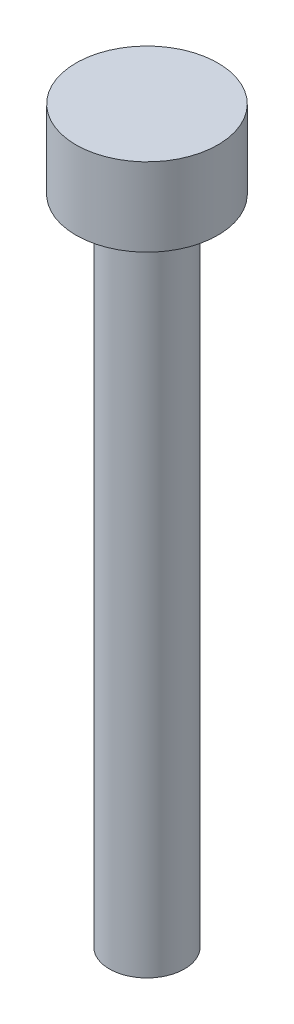
ISO-10303-21;
HEADER;
FILE_DESCRIPTION(('STEP AP214'),'2;1');
FILE_NAME('part.step','',(''),(''),'','','');
FILE_SCHEMA(('AUTOMOTIVE_DESIGN { 1 0 10303 214 1 1 1 1 }'));
ENDSEC;
DATA;
#1=APPLICATION_CONTEXT('core data for automotive mechanical design processes');
#2=APPLICATION_PROTOCOL_DEFINITION('international standard','automotive_design',2000,#1);
#3=PRODUCT_CONTEXT('',#1,'mechanical');
#4=PRODUCT('Part','Part','',(#3));
#5=PRODUCT_RELATED_PRODUCT_CATEGORY('part','',(#4));
#6=PRODUCT_DEFINITION_FORMATION('','',#4);
#7=PRODUCT_DEFINITION_CONTEXT('part definition',#1,'design');
#8=PRODUCT_DEFINITION('design','',#6,#7);
#9=PRODUCT_DEFINITION_SHAPE('','',#8);
#10=(LENGTH_UNIT() NAMED_UNIT(*) SI_UNIT(.MILLI.,.METRE.));
#11=(NAMED_UNIT(*) PLANE_ANGLE_UNIT() SI_UNIT($,.RADIAN.));
#12=(NAMED_UNIT(*) SI_UNIT($,.STERADIAN.) SOLID_ANGLE_UNIT());
#13=UNCERTAINTY_MEASURE_WITH_UNIT(LENGTH_MEASURE(1.E-05),#10,'distance_accuracy_value','');
#14=(GEOMETRIC_REPRESENTATION_CONTEXT(3) GLOBAL_UNCERTAINTY_ASSIGNED_CONTEXT((#13)) GLOBAL_UNIT_ASSIGNED_CONTEXT((#10,
#11,#12)) REPRESENTATION_CONTEXT('',''));
#15=CARTESIAN_POINT('',(0.,0.,0.));
#16=DIRECTION('',(0.,0.,1.));
#17=DIRECTION('',(1.,0.,0.));
#18=AXIS2_PLACEMENT_3D('',#15,#16,#17);
#19=CARTESIAN_POINT('',(0.,3.,0.));
#20=DIRECTION('',(0.,-1.,0.));
#21=DIRECTION('',(0.,0.,-1.));
#22=AXIS2_PLACEMENT_3D('',#19,#20,#21);
#23=CYLINDRICAL_SURFACE('',#22,2.72);
#24=CARTESIAN_POINT('',(0.,3.,0.));
#25=DIRECTION('',(0.,1.,0.));
#26=DIRECTION('',(0.,0.,1.));
#27=AXIS2_PLACEMENT_3D('',#24,#25,#26);
#28=CIRCLE('',#27,2.72);
#29=CARTESIAN_POINT('',(0.,3.,2.72));
#30=VERTEX_POINT('',#29);
#31=EDGE_CURVE('E40',#30,#30,#28,.T.);
#32=ORIENTED_EDGE('',*,*,#31,.F.);
#33=EDGE_LOOP('',(#32));
#34=FACE_BOUND('',#33,.T.);
#35=CARTESIAN_POINT('',(0.,0.,0.));
#36=DIRECTION('',(0.,1.,0.));
#37=DIRECTION('',(0.,0.,1.));
#38=AXIS2_PLACEMENT_3D('',#35,#36,#37);
#39=CIRCLE('',#38,2.72);
#40=CARTESIAN_POINT('',(0.,0.,2.72));
#41=VERTEX_POINT('',#40);
#42=EDGE_CURVE('E36',#41,#41,#39,.T.);
#43=ORIENTED_EDGE('',*,*,#42,.T.);
#44=EDGE_LOOP('',(#43));
#45=FACE_BOUND('',#44,.T.);
#46=ADVANCED_FACE('F33',(#34,#45),#23,.T.);
#47=CARTESIAN_POINT('',(0.,3.,0.));
#48=DIRECTION('',(0.,1.,0.));
#49=DIRECTION('',(0.,0.,1.));
#50=AXIS2_PLACEMENT_3D('',#47,#48,#49);
#51=PLANE('',#50);
#52=ORIENTED_EDGE('',*,*,#31,.T.);
#53=EDGE_LOOP('',(#52));
#54=FACE_BOUND('',#53,.T.);
#55=ADVANCED_FACE('F57',(#54),#51,.T.);
#56=CARTESIAN_POINT('',(0.,0.,0.));
#57=DIRECTION('',(0.,1.,0.));
#58=DIRECTION('',(0.,0.,1.));
#59=AXIS2_PLACEMENT_3D('',#56,#57,#58);
#60=PLANE('',#59);
#61=CARTESIAN_POINT('',(0.,0.,0.));
#62=DIRECTION('',(0.,-1.,0.));
#63=DIRECTION('',(0.,0.,-1.));
#64=AXIS2_PLACEMENT_3D('',#61,#62,#63);
#65=CIRCLE('',#64,1.44);
#66=CARTESIAN_POINT('',(0.,0.,-1.44));
#67=VERTEX_POINT('',#66);
#68=EDGE_CURVE('E10',#67,#67,#65,.T.);
#69=ORIENTED_EDGE('',*,*,#68,.F.);
#70=EDGE_LOOP('',(#69));
#71=FACE_BOUND('',#70,.T.);
#72=ORIENTED_EDGE('',*,*,#42,.F.);
#73=EDGE_LOOP('',(#72));
#74=FACE_BOUND('',#73,.T.);
#75=ADVANCED_FACE('F54',(#71,#74),#60,.F.);
#76=CARTESIAN_POINT('',(0.,-25.,0.));
#77=DIRECTION('',(0.,1.,0.));
#78=DIRECTION('',(0.,0.,1.));
#79=AXIS2_PLACEMENT_3D('',#76,#77,#78);
#80=CYLINDRICAL_SURFACE('',#79,1.44);
#81=CARTESIAN_POINT('',(0.,-25.,0.));
#82=DIRECTION('',(0.,-1.,0.));
#83=DIRECTION('',(0.,0.,-1.));
#84=AXIS2_PLACEMENT_3D('',#81,#82,#83);
#85=CIRCLE('',#84,1.44);
#86=CARTESIAN_POINT('',(0.,-25.,-1.44));
#87=VERTEX_POINT('',#86);
#88=EDGE_CURVE('E46',#87,#87,#85,.T.);
#89=ORIENTED_EDGE('',*,*,#88,.F.);
#90=EDGE_LOOP('',(#89));
#91=FACE_BOUND('',#90,.T.);
#92=ORIENTED_EDGE('',*,*,#68,.T.);
#93=EDGE_LOOP('',(#92));
#94=FACE_BOUND('',#93,.T.);
#95=ADVANCED_FACE('F56',(#91,#94),#80,.T.);
#96=CARTESIAN_POINT('',(0.,-25.,0.));
#97=DIRECTION('',(0.,-1.,0.));
#98=DIRECTION('',(0.,0.,-1.));
#99=AXIS2_PLACEMENT_3D('',#96,#97,#98);
#100=PLANE('',#99);
#101=ORIENTED_EDGE('',*,*,#88,.T.);
#102=EDGE_LOOP('',(#101));
#103=FACE_BOUND('',#102,.T.);
#104=ADVANCED_FACE('F63',(#103),#100,.T.);
#105=CLOSED_SHELL('',(#46,#55,#75,#95,#104));
#106=MANIFOLD_SOLID_BREP('B2',#105);
#107=ADVANCED_BREP_SHAPE_REPRESENTATION('',(#18,#106),#14);
#108=SHAPE_DEFINITION_REPRESENTATION(#9,#107);
ENDSEC;
END-ISO-10303-21;
